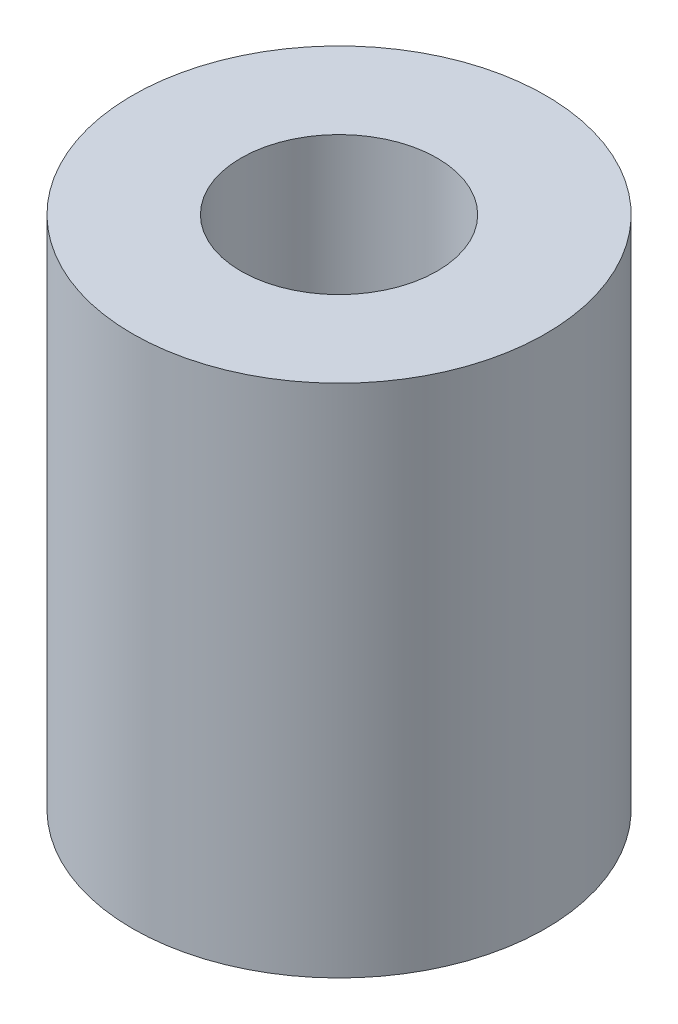
ISO-10303-21;
HEADER;
FILE_DESCRIPTION(('STEP AP214'),'2;1');
FILE_NAME('part.step','',(''),(''),'','','');
FILE_SCHEMA(('AUTOMOTIVE_DESIGN { 1 0 10303 214 1 1 1 1 }'));
ENDSEC;
DATA;
#1=APPLICATION_CONTEXT('core data for automotive mechanical design processes');
#2=APPLICATION_PROTOCOL_DEFINITION('international standard','automotive_design',2000,#1);
#3=PRODUCT_CONTEXT('',#1,'mechanical');
#4=PRODUCT('Part','Part','',(#3));
#5=PRODUCT_RELATED_PRODUCT_CATEGORY('part','',(#4));
#6=PRODUCT_DEFINITION_FORMATION('','',#4);
#7=PRODUCT_DEFINITION_CONTEXT('part definition',#1,'design');
#8=PRODUCT_DEFINITION('design','',#6,#7);
#9=PRODUCT_DEFINITION_SHAPE('','',#8);
#10=(LENGTH_UNIT() NAMED_UNIT(*) SI_UNIT(.MILLI.,.METRE.));
#11=(NAMED_UNIT(*) PLANE_ANGLE_UNIT() SI_UNIT($,.RADIAN.));
#12=(NAMED_UNIT(*) SI_UNIT($,.STERADIAN.) SOLID_ANGLE_UNIT());
#13=UNCERTAINTY_MEASURE_WITH_UNIT(LENGTH_MEASURE(1.E-05),#10,'distance_accuracy_value','');
#14=(GEOMETRIC_REPRESENTATION_CONTEXT(3) GLOBAL_UNCERTAINTY_ASSIGNED_CONTEXT((#13)) GLOBAL_UNIT_ASSIGNED_CONTEXT((#10,
#11,#12)) REPRESENTATION_CONTEXT('',''));
#15=CARTESIAN_POINT('',(0.,0.,0.));
#16=DIRECTION('',(0.,0.,1.));
#17=DIRECTION('',(1.,0.,0.));
#18=AXIS2_PLACEMENT_3D('',#15,#16,#17);
#19=CARTESIAN_POINT('',(0.,25.019,0.));
#20=DIRECTION('',(0.,-1.,0.));
#21=DIRECTION('',(0.,0.,-1.));
#22=AXIS2_PLACEMENT_3D('',#19,#20,#21);
#23=CYLINDRICAL_SURFACE('',#22,10.033);
#24=CARTESIAN_POINT('',(0.,25.019,0.));
#25=DIRECTION('',(0.,1.,0.));
#26=DIRECTION('',(0.,0.,1.));
#27=AXIS2_PLACEMENT_3D('',#24,#25,#26);
#28=CIRCLE('',#27,10.033);
#29=CARTESIAN_POINT('',(0.,25.019,10.033));
#30=VERTEX_POINT('',#29);
#31=EDGE_CURVE('E10',#30,#30,#28,.T.);
#32=ORIENTED_EDGE('',*,*,#31,.F.);
#33=EDGE_LOOP('',(#32));
#34=FACE_BOUND('',#33,.T.);
#35=CARTESIAN_POINT('',(0.,0.,0.));
#36=DIRECTION('',(0.,1.,0.));
#37=DIRECTION('',(0.,0.,1.));
#38=AXIS2_PLACEMENT_3D('',#35,#36,#37);
#39=CIRCLE('',#38,10.033);
#40=CARTESIAN_POINT('',(0.,0.,10.033));
#41=VERTEX_POINT('',#40);
#42=EDGE_CURVE('E34',#41,#41,#39,.T.);
#43=ORIENTED_EDGE('',*,*,#42,.T.);
#44=EDGE_LOOP('',(#43));
#45=FACE_BOUND('',#44,.T.);
#46=ADVANCED_FACE('F31',(#34,#45),#23,.T.);
#47=CARTESIAN_POINT('',(0.,25.019,0.));
#48=DIRECTION('',(0.,1.,0.));
#49=DIRECTION('',(0.,0.,1.));
#50=AXIS2_PLACEMENT_3D('',#47,#48,#49);
#51=PLANE('',#50);
#52=CARTESIAN_POINT('',(0.,25.019,0.));
#53=DIRECTION('',(0.,1.,0.));
#54=DIRECTION('',(0.,0.,1.));
#55=AXIS2_PLACEMENT_3D('',#52,#53,#54);
#56=CIRCLE('',#55,4.7625);
#57=CARTESIAN_POINT('',(0.,25.019,4.7625));
#58=VERTEX_POINT('',#57);
#59=EDGE_CURVE('E51',#58,#58,#56,.T.);
#60=ORIENTED_EDGE('',*,*,#59,.F.);
#61=EDGE_LOOP('',(#60));
#62=FACE_BOUND('',#61,.T.);
#63=ORIENTED_EDGE('',*,*,#31,.T.);
#64=EDGE_LOOP('',(#63));
#65=FACE_BOUND('',#64,.T.);
#66=ADVANCED_FACE('F58',(#62,#65),#51,.T.);
#67=CARTESIAN_POINT('',(0.,0.,0.));
#68=DIRECTION('',(0.,1.,0.));
#69=DIRECTION('',(0.,0.,1.));
#70=AXIS2_PLACEMENT_3D('',#67,#68,#69);
#71=PLANE('',#70);
#72=CARTESIAN_POINT('',(0.,0.,0.));
#73=DIRECTION('',(0.,-1.,0.));
#74=DIRECTION('',(0.,0.,-1.));
#75=AXIS2_PLACEMENT_3D('',#72,#73,#74);
#76=CIRCLE('',#75,4.);
#77=CARTESIAN_POINT('',(0.,0.,-4.));
#78=VERTEX_POINT('',#77);
#79=EDGE_CURVE('E41',#78,#78,#76,.T.);
#80=ORIENTED_EDGE('',*,*,#79,.F.);
#81=EDGE_LOOP('',(#80));
#82=FACE_BOUND('',#81,.T.);
#83=ORIENTED_EDGE('',*,*,#42,.F.);
#84=EDGE_LOOP('',(#83));
#85=FACE_BOUND('',#84,.T.);
#86=ADVANCED_FACE('F60',(#82,#85),#71,.F.);
#87=CARTESIAN_POINT('',(0.,10.16,0.));
#88=DIRECTION('',(0.,-1.,0.));
#89=DIRECTION('',(0.,0.,-1.));
#90=AXIS2_PLACEMENT_3D('',#87,#88,#89);
#91=CYLINDRICAL_SURFACE('',#90,4.);
#92=CARTESIAN_POINT('',(0.,10.16,0.));
#93=DIRECTION('',(0.,-1.,0.));
#94=DIRECTION('',(0.,0.,-1.));
#95=AXIS2_PLACEMENT_3D('',#92,#93,#94);
#96=CIRCLE('',#95,4.);
#97=CARTESIAN_POINT('',(0.,10.16,-4.));
#98=VERTEX_POINT('',#97);
#99=EDGE_CURVE('E45',#98,#98,#96,.F.);
#100=ORIENTED_EDGE('',*,*,#99,.T.);
#101=EDGE_LOOP('',(#100));
#102=FACE_BOUND('',#101,.T.);
#103=ORIENTED_EDGE('',*,*,#79,.T.);
#104=EDGE_LOOP('',(#103));
#105=FACE_BOUND('',#104,.T.);
#106=ADVANCED_FACE('F66',(#102,#105),#91,.F.);
#107=CARTESIAN_POINT('',(0.,10.16,0.));
#108=DIRECTION('',(0.,-1.,0.));
#109=DIRECTION('',(0.,0.,-1.));
#110=AXIS2_PLACEMENT_3D('',#107,#108,#109);
#111=PLANE('',#110);
#112=CARTESIAN_POINT('',(0.,10.16,0.));
#113=DIRECTION('',(0.,-1.,0.));
#114=DIRECTION('',(0.,0.,-1.));
#115=AXIS2_PLACEMENT_3D('',#112,#113,#114);
#116=CIRCLE('',#115,4.7625);
#117=CARTESIAN_POINT('',(0.,10.16,-4.7625));
#118=VERTEX_POINT('',#117);
#119=EDGE_CURVE('E48',#118,#118,#116,.F.);
#120=ORIENTED_EDGE('',*,*,#119,.T.);
#121=EDGE_LOOP('',(#120));
#122=FACE_BOUND('',#121,.T.);
#123=ORIENTED_EDGE('',*,*,#99,.F.);
#124=EDGE_LOOP('',(#123));
#125=FACE_BOUND('',#124,.T.);
#126=ADVANCED_FACE('F72',(#122,#125),#111,.F.);
#127=CARTESIAN_POINT('',(0.,-3.31038418160373,0.));
#128=DIRECTION('',(0.,1.,0.));
#129=DIRECTION('',(0.,0.,1.));
#130=AXIS2_PLACEMENT_3D('',#127,#128,#129);
#131=CYLINDRICAL_SURFACE('',#130,4.7625);
#132=ORIENTED_EDGE('',*,*,#59,.T.);
#133=EDGE_LOOP('',(#132));
#134=FACE_BOUND('',#133,.T.);
#135=ORIENTED_EDGE('',*,*,#119,.F.);
#136=EDGE_LOOP('',(#135));
#137=FACE_BOUND('',#136,.T.);
#138=ADVANCED_FACE('F55',(#134,#137),#131,.F.);
#139=CLOSED_SHELL('',(#46,#66,#86,#106,#126,#138));
#140=MANIFOLD_SOLID_BREP('B2',#139);
#141=ADVANCED_BREP_SHAPE_REPRESENTATION('',(#18,#140),#14);
#142=SHAPE_DEFINITION_REPRESENTATION(#9,#141);
ENDSEC;
END-ISO-10303-21;
